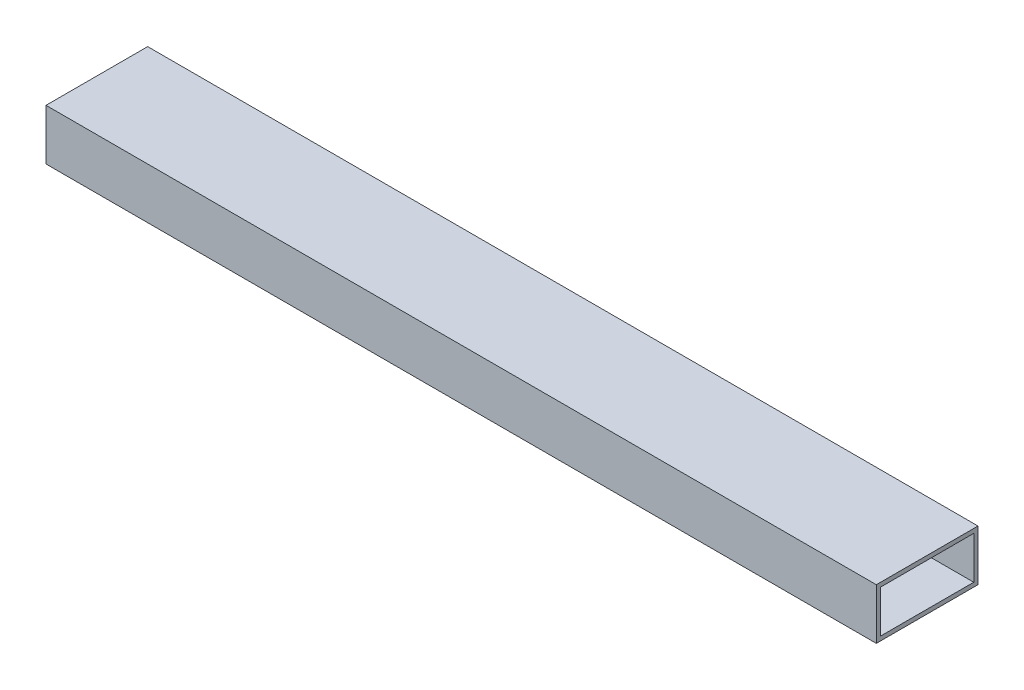
ISO-10303-21;
HEADER;
FILE_DESCRIPTION(('STEP AP214'),'2;1');
FILE_NAME('part.step','',(''),(''),'','','');
FILE_SCHEMA(('AUTOMOTIVE_DESIGN { 1 0 10303 214 1 1 1 1 }'));
ENDSEC;
DATA;
#1=APPLICATION_CONTEXT('core data for automotive mechanical design processes');
#2=APPLICATION_PROTOCOL_DEFINITION('international standard','automotive_design',2000,#1);
#3=PRODUCT_CONTEXT('',#1,'mechanical');
#4=PRODUCT('Part','Part','',(#3));
#5=PRODUCT_RELATED_PRODUCT_CATEGORY('part','',(#4));
#6=PRODUCT_DEFINITION_FORMATION('','',#4);
#7=PRODUCT_DEFINITION_CONTEXT('part definition',#1,'design');
#8=PRODUCT_DEFINITION('design','',#6,#7);
#9=PRODUCT_DEFINITION_SHAPE('','',#8);
#10=(LENGTH_UNIT() NAMED_UNIT(*) SI_UNIT(.MILLI.,.METRE.));
#11=(NAMED_UNIT(*) PLANE_ANGLE_UNIT() SI_UNIT($,.RADIAN.));
#12=(NAMED_UNIT(*) SI_UNIT($,.STERADIAN.) SOLID_ANGLE_UNIT());
#13=UNCERTAINTY_MEASURE_WITH_UNIT(LENGTH_MEASURE(1.E-05),#10,'distance_accuracy_value','');
#14=(GEOMETRIC_REPRESENTATION_CONTEXT(3) GLOBAL_UNCERTAINTY_ASSIGNED_CONTEXT((#13)) GLOBAL_UNIT_ASSIGNED_CONTEXT((#10,
#11,#12)) REPRESENTATION_CONTEXT('',''));
#15=CARTESIAN_POINT('',(0.,0.,0.));
#16=DIRECTION('',(0.,0.,1.));
#17=DIRECTION('',(1.,0.,0.));
#18=AXIS2_PLACEMENT_3D('',#15,#16,#17);
#19=CARTESIAN_POINT('',(311.15,0.,0.));
#20=DIRECTION('',(1.,0.,0.));
#21=DIRECTION('',(0.,0.,-1.));
#22=AXIS2_PLACEMENT_3D('',#19,#20,#21);
#23=PLANE('',#22);
#24=DIRECTION('',(0.,1.,0.));
#25=VECTOR('',#24,1.);
#26=CARTESIAN_POINT('',(311.15,0.,-76.2));
#27=LINE('',#26,#25);
#28=CARTESIAN_POINT('',(311.15,0.,-76.2));
#29=VERTEX_POINT('',#28);
#30=CARTESIAN_POINT('',(311.15,38.1,-76.2));
#31=VERTEX_POINT('',#30);
#32=EDGE_CURVE('E139',#29,#31,#27,.T.);
#33=ORIENTED_EDGE('',*,*,#32,.T.);
#34=DIRECTION('',(0.,0.,1.));
#35=VECTOR('',#34,1.);
#36=CARTESIAN_POINT('',(311.15,38.1,-76.2));
#37=LINE('',#36,#35);
#38=CARTESIAN_POINT('',(311.15,38.1,0.));
#39=VERTEX_POINT('',#38);
#40=EDGE_CURVE('E142',#31,#39,#37,.T.);
#41=ORIENTED_EDGE('',*,*,#40,.T.);
#42=DIRECTION('',(0.,-1.,0.));
#43=VECTOR('',#42,1.);
#44=CARTESIAN_POINT('',(311.15,0.,0.));
#45=LINE('',#44,#43);
#46=CARTESIAN_POINT('',(311.15,0.,0.));
#47=VERTEX_POINT('',#46);
#48=EDGE_CURVE('E145',#39,#47,#45,.T.);
#49=ORIENTED_EDGE('',*,*,#48,.T.);
#50=DIRECTION('',(0.,0.,-1.));
#51=VECTOR('',#50,1.);
#52=CARTESIAN_POINT('',(311.15,0.,-76.2));
#53=LINE('',#52,#51);
#54=EDGE_CURVE('E147',#47,#29,#53,.T.);
#55=ORIENTED_EDGE('',*,*,#54,.T.);
#56=EDGE_LOOP('',(#33,#41,#49,#55));
#57=FACE_BOUND('',#56,.T.);
#58=DIRECTION('',(0.,0.,1.));
#59=VECTOR('',#58,1.);
#60=CARTESIAN_POINT('',(311.15,34.925,-73.025));
#61=LINE('',#60,#59);
#62=CARTESIAN_POINT('',(311.15,34.925,-73.025));
#63=VERTEX_POINT('',#62);
#64=CARTESIAN_POINT('',(311.15,34.925,-3.175));
#65=VERTEX_POINT('',#64);
#66=EDGE_CURVE('E109',#63,#65,#61,.T.);
#67=ORIENTED_EDGE('',*,*,#66,.F.);
#68=DIRECTION('',(0.,1.,0.));
#69=VECTOR('',#68,1.);
#70=CARTESIAN_POINT('',(311.15,3.175,-73.025));
#71=LINE('',#70,#69);
#72=CARTESIAN_POINT('',(311.15,3.175,-73.025));
#73=VERTEX_POINT('',#72);
#74=EDGE_CURVE('E101',#73,#63,#71,.T.);
#75=ORIENTED_EDGE('',*,*,#74,.F.);
#76=DIRECTION('',(0.,0.,-1.));
#77=VECTOR('',#76,1.);
#78=CARTESIAN_POINT('',(311.15,3.175,-73.025));
#79=LINE('',#78,#77);
#80=CARTESIAN_POINT('',(311.15,3.175,-3.175));
#81=VERTEX_POINT('',#80);
#82=EDGE_CURVE('E123',#81,#73,#79,.T.);
#83=ORIENTED_EDGE('',*,*,#82,.F.);
#84=DIRECTION('',(0.,-1.,0.));
#85=VECTOR('',#84,1.);
#86=CARTESIAN_POINT('',(311.15,3.175,-3.175));
#87=LINE('',#86,#85);
#88=EDGE_CURVE('E121',#65,#81,#87,.T.);
#89=ORIENTED_EDGE('',*,*,#88,.F.);
#90=EDGE_LOOP('',(#67,#75,#83,#89));
#91=FACE_BOUND('',#90,.T.);
#92=ADVANCED_FACE('F36',(#57,#91),#23,.T.);
#93=CARTESIAN_POINT('',(-311.15,0.,0.));
#94=DIRECTION('',(1.,0.,0.));
#95=DIRECTION('',(0.,0.,-1.));
#96=AXIS2_PLACEMENT_3D('',#93,#94,#95);
#97=PLANE('',#96);
#98=DIRECTION('',(0.,1.,0.));
#99=VECTOR('',#98,1.);
#100=CARTESIAN_POINT('',(-311.15,0.,-76.2));
#101=LINE('',#100,#99);
#102=CARTESIAN_POINT('',(-311.15,0.,-76.2));
#103=VERTEX_POINT('',#102);
#104=CARTESIAN_POINT('',(-311.15,38.1,-76.2));
#105=VERTEX_POINT('',#104);
#106=EDGE_CURVE('E117',#103,#105,#101,.T.);
#107=ORIENTED_EDGE('',*,*,#106,.F.);
#108=DIRECTION('',(0.,0.,-1.));
#109=VECTOR('',#108,1.);
#110=CARTESIAN_POINT('',(-311.15,0.,-76.2));
#111=LINE('',#110,#109);
#112=CARTESIAN_POINT('',(-311.15,0.,0.));
#113=VERTEX_POINT('',#112);
#114=EDGE_CURVE('E143',#113,#103,#111,.T.);
#115=ORIENTED_EDGE('',*,*,#114,.F.);
#116=DIRECTION('',(0.,-1.,0.));
#117=VECTOR('',#116,1.);
#118=CARTESIAN_POINT('',(-311.15,0.,0.));
#119=LINE('',#118,#117);
#120=CARTESIAN_POINT('',(-311.15,38.1,0.));
#121=VERTEX_POINT('',#120);
#122=EDGE_CURVE('E154',#121,#113,#119,.T.);
#123=ORIENTED_EDGE('',*,*,#122,.F.);
#124=DIRECTION('',(0.,0.,1.));
#125=VECTOR('',#124,1.);
#126=CARTESIAN_POINT('',(-311.15,38.1,-76.2));
#127=LINE('',#126,#125);
#128=EDGE_CURVE('E152',#105,#121,#127,.T.);
#129=ORIENTED_EDGE('',*,*,#128,.F.);
#130=EDGE_LOOP('',(#107,#115,#123,#129));
#131=FACE_BOUND('',#130,.T.);
#132=DIRECTION('',(0.,1.,0.));
#133=VECTOR('',#132,1.);
#134=CARTESIAN_POINT('',(-311.15,3.175,-73.025));
#135=LINE('',#134,#133);
#136=CARTESIAN_POINT('',(-311.15,3.175,-73.025));
#137=VERTEX_POINT('',#136);
#138=CARTESIAN_POINT('',(-311.15,34.925,-73.025));
#139=VERTEX_POINT('',#138);
#140=EDGE_CURVE('E59',#137,#139,#135,.T.);
#141=ORIENTED_EDGE('',*,*,#140,.T.);
#142=DIRECTION('',(0.,0.,1.));
#143=VECTOR('',#142,1.);
#144=CARTESIAN_POINT('',(-311.15,34.925,-73.025));
#145=LINE('',#144,#143);
#146=CARTESIAN_POINT('',(-311.15,34.925,-3.175));
#147=VERTEX_POINT('',#146);
#148=EDGE_CURVE('E116',#139,#147,#145,.T.);
#149=ORIENTED_EDGE('',*,*,#148,.T.);
#150=DIRECTION('',(0.,-1.,0.));
#151=VECTOR('',#150,1.);
#152=CARTESIAN_POINT('',(-311.15,3.175,-3.175));
#153=LINE('',#152,#151);
#154=CARTESIAN_POINT('',(-311.15,3.175,-3.175));
#155=VERTEX_POINT('',#154);
#156=EDGE_CURVE('E131',#147,#155,#153,.T.);
#157=ORIENTED_EDGE('',*,*,#156,.T.);
#158=DIRECTION('',(0.,0.,-1.));
#159=VECTOR('',#158,1.);
#160=CARTESIAN_POINT('',(-311.15,3.175,-73.025));
#161=LINE('',#160,#159);
#162=EDGE_CURVE('E110',#155,#137,#161,.T.);
#163=ORIENTED_EDGE('',*,*,#162,.T.);
#164=EDGE_LOOP('',(#141,#149,#157,#163));
#165=FACE_BOUND('',#164,.T.);
#166=ADVANCED_FACE('F172',(#131,#165),#97,.F.);
#167=CARTESIAN_POINT('',(311.15,0.,-76.2));
#168=DIRECTION('',(0.,0.,1.));
#169=DIRECTION('',(0.,-1.,0.));
#170=AXIS2_PLACEMENT_3D('',#167,#168,#169);
#171=PLANE('',#170);
#172=CARTESIAN_POINT('',(-260.35,19.05,-76.2));
#173=DIRECTION('',(0.,0.,-1.));
#174=DIRECTION('',(0.,1.,0.));
#175=AXIS2_PLACEMENT_3D('',#172,#173,#174);
#176=CIRCLE('',#175,2.55269999999996);
#177=CARTESIAN_POINT('',(-260.35,21.6027,-76.2));
#178=VERTEX_POINT('',#177);
#179=EDGE_CURVE('E220',#178,#178,#176,.T.);
#180=ORIENTED_EDGE('',*,*,#179,.F.);
#181=EDGE_LOOP('',(#180));
#182=FACE_BOUND('',#181,.T.);
#183=CARTESIAN_POINT('',(260.35,19.05,-76.2));
#184=DIRECTION('',(0.,0.,-1.));
#185=DIRECTION('',(0.,1.,0.));
#186=AXIS2_PLACEMENT_3D('',#183,#184,#185);
#187=CIRCLE('',#186,2.55269999999996);
#188=CARTESIAN_POINT('',(260.35,21.6027,-76.2));
#189=VERTEX_POINT('',#188);
#190=EDGE_CURVE('E215',#189,#189,#187,.T.);
#191=ORIENTED_EDGE('',*,*,#190,.F.);
#192=EDGE_LOOP('',(#191));
#193=FACE_BOUND('',#192,.T.);
#194=ORIENTED_EDGE('',*,*,#106,.T.);
#195=DIRECTION('',(-1.,0.,0.));
#196=VECTOR('',#195,1.);
#197=CARTESIAN_POINT('',(311.15,38.1,-76.2));
#198=LINE('',#197,#196);
#199=EDGE_CURVE('E11',#31,#105,#198,.T.);
#200=ORIENTED_EDGE('',*,*,#199,.F.);
#201=ORIENTED_EDGE('',*,*,#32,.F.);
#202=DIRECTION('',(-1.,0.,0.));
#203=VECTOR('',#202,1.);
#204=CARTESIAN_POINT('',(311.15,0.,-76.2));
#205=LINE('',#204,#203);
#206=EDGE_CURVE('E149',#29,#103,#205,.T.);
#207=ORIENTED_EDGE('',*,*,#206,.T.);
#208=EDGE_LOOP('',(#194,#200,#201,#207));
#209=FACE_BOUND('',#208,.T.);
#210=ADVANCED_FACE('F38',(#182,#193,#209),#171,.F.);
#211=CARTESIAN_POINT('',(311.15,38.1,-76.2));
#212=DIRECTION('',(0.,-1.,0.));
#213=DIRECTION('',(0.,0.,-1.));
#214=AXIS2_PLACEMENT_3D('',#211,#212,#213);
#215=PLANE('',#214);
#216=ORIENTED_EDGE('',*,*,#128,.T.);
#217=DIRECTION('',(-1.,0.,0.));
#218=VECTOR('',#217,1.);
#219=CARTESIAN_POINT('',(311.15,38.1,0.));
#220=LINE('',#219,#218);
#221=EDGE_CURVE('E44',#39,#121,#220,.T.);
#222=ORIENTED_EDGE('',*,*,#221,.F.);
#223=ORIENTED_EDGE('',*,*,#40,.F.);
#224=ORIENTED_EDGE('',*,*,#199,.T.);
#225=EDGE_LOOP('',(#216,#222,#223,#224));
#226=FACE_BOUND('',#225,.T.);
#227=ADVANCED_FACE('F182',(#226),#215,.F.);
#228=CARTESIAN_POINT('',(311.15,0.,0.));
#229=DIRECTION('',(0.,0.,-1.));
#230=DIRECTION('',(0.,1.,0.));
#231=AXIS2_PLACEMENT_3D('',#228,#229,#230);
#232=PLANE('',#231);
#233=ORIENTED_EDGE('',*,*,#122,.T.);
#234=DIRECTION('',(-1.,0.,0.));
#235=VECTOR('',#234,1.);
#236=CARTESIAN_POINT('',(311.15,0.,0.));
#237=LINE('',#236,#235);
#238=EDGE_CURVE('E159',#47,#113,#237,.T.);
#239=ORIENTED_EDGE('',*,*,#238,.F.);
#240=ORIENTED_EDGE('',*,*,#48,.F.);
#241=ORIENTED_EDGE('',*,*,#221,.T.);
#242=EDGE_LOOP('',(#233,#239,#240,#241));
#243=FACE_BOUND('',#242,.T.);
#244=ADVANCED_FACE('F166',(#243),#232,.F.);
#245=CARTESIAN_POINT('',(311.15,0.,-76.2));
#246=DIRECTION('',(0.,1.,0.));
#247=DIRECTION('',(0.,0.,1.));
#248=AXIS2_PLACEMENT_3D('',#245,#246,#247);
#249=PLANE('',#248);
#250=ORIENTED_EDGE('',*,*,#114,.T.);
#251=ORIENTED_EDGE('',*,*,#206,.F.);
#252=ORIENTED_EDGE('',*,*,#54,.F.);
#253=ORIENTED_EDGE('',*,*,#238,.T.);
#254=EDGE_LOOP('',(#250,#251,#252,#253));
#255=FACE_BOUND('',#254,.T.);
#256=ADVANCED_FACE('F176',(#255),#249,.F.);
#257=CARTESIAN_POINT('',(311.15,3.175,-73.025));
#258=DIRECTION('',(0.,0.,1.));
#259=DIRECTION('',(1.,0.,0.));
#260=AXIS2_PLACEMENT_3D('',#257,#258,#259);
#261=PLANE('',#260);
#262=CARTESIAN_POINT('',(-260.35,19.05,-73.025));
#263=DIRECTION('',(0.,0.,1.));
#264=DIRECTION('',(1.,0.,0.));
#265=AXIS2_PLACEMENT_3D('',#262,#263,#264);
#266=CIRCLE('',#265,2.55269999999999);
#267=CARTESIAN_POINT('',(-257.7973,19.05,-73.025));
#268=VERTEX_POINT('',#267);
#269=EDGE_CURVE('E211',#268,#268,#266,.T.);
#270=ORIENTED_EDGE('',*,*,#269,.F.);
#271=EDGE_LOOP('',(#270));
#272=FACE_BOUND('',#271,.T.);
#273=CARTESIAN_POINT('',(260.35,19.05,-73.025));
#274=DIRECTION('',(0.,0.,1.));
#275=DIRECTION('',(1.,0.,0.));
#276=AXIS2_PLACEMENT_3D('',#273,#274,#275);
#277=CIRCLE('',#276,2.55269999999999);
#278=CARTESIAN_POINT('',(262.9027,19.05,-73.025));
#279=VERTEX_POINT('',#278);
#280=EDGE_CURVE('E129',#279,#279,#277,.T.);
#281=ORIENTED_EDGE('',*,*,#280,.F.);
#282=EDGE_LOOP('',(#281));
#283=FACE_BOUND('',#282,.T.);
#284=ORIENTED_EDGE('',*,*,#140,.F.);
#285=DIRECTION('',(-1.,0.,0.));
#286=VECTOR('',#285,1.);
#287=CARTESIAN_POINT('',(311.15,3.175,-73.025));
#288=LINE('',#287,#286);
#289=EDGE_CURVE('E105',#73,#137,#288,.T.);
#290=ORIENTED_EDGE('',*,*,#289,.F.);
#291=ORIENTED_EDGE('',*,*,#74,.T.);
#292=DIRECTION('',(-1.,0.,0.));
#293=VECTOR('',#292,1.);
#294=CARTESIAN_POINT('',(311.15,34.925,-73.025));
#295=LINE('',#294,#293);
#296=EDGE_CURVE('E104',#63,#139,#295,.T.);
#297=ORIENTED_EDGE('',*,*,#296,.T.);
#298=EDGE_LOOP('',(#284,#290,#291,#297));
#299=FACE_BOUND('',#298,.T.);
#300=ADVANCED_FACE('F103',(#272,#283,#299),#261,.T.);
#301=CARTESIAN_POINT('',(311.15,34.925,-73.025));
#302=DIRECTION('',(0.,-1.,0.));
#303=DIRECTION('',(0.,0.,-1.));
#304=AXIS2_PLACEMENT_3D('',#301,#302,#303);
#305=PLANE('',#304);
#306=ORIENTED_EDGE('',*,*,#148,.F.);
#307=ORIENTED_EDGE('',*,*,#296,.F.);
#308=ORIENTED_EDGE('',*,*,#66,.T.);
#309=DIRECTION('',(-1.,0.,0.));
#310=VECTOR('',#309,1.);
#311=CARTESIAN_POINT('',(311.15,34.925,-3.175));
#312=LINE('',#311,#310);
#313=EDGE_CURVE('E118',#65,#147,#312,.T.);
#314=ORIENTED_EDGE('',*,*,#313,.T.);
#315=EDGE_LOOP('',(#306,#307,#308,#314));
#316=FACE_BOUND('',#315,.T.);
#317=ADVANCED_FACE('F113',(#316),#305,.T.);
#318=CARTESIAN_POINT('',(311.15,3.175,-3.175));
#319=DIRECTION('',(0.,0.,-1.));
#320=DIRECTION('',(-1.,0.,0.));
#321=AXIS2_PLACEMENT_3D('',#318,#319,#320);
#322=PLANE('',#321);
#323=ORIENTED_EDGE('',*,*,#156,.F.);
#324=ORIENTED_EDGE('',*,*,#313,.F.);
#325=ORIENTED_EDGE('',*,*,#88,.T.);
#326=DIRECTION('',(-1.,0.,0.));
#327=VECTOR('',#326,1.);
#328=CARTESIAN_POINT('',(311.15,3.175,-3.175));
#329=LINE('',#328,#327);
#330=EDGE_CURVE('E51',#81,#155,#329,.T.);
#331=ORIENTED_EDGE('',*,*,#330,.T.);
#332=EDGE_LOOP('',(#323,#324,#325,#331));
#333=FACE_BOUND('',#332,.T.);
#334=ADVANCED_FACE('F207',(#333),#322,.T.);
#335=CARTESIAN_POINT('',(311.15,3.175,-73.025));
#336=DIRECTION('',(0.,1.,0.));
#337=DIRECTION('',(0.,0.,1.));
#338=AXIS2_PLACEMENT_3D('',#335,#336,#337);
#339=PLANE('',#338);
#340=ORIENTED_EDGE('',*,*,#162,.F.);
#341=ORIENTED_EDGE('',*,*,#330,.F.);
#342=ORIENTED_EDGE('',*,*,#82,.T.);
#343=ORIENTED_EDGE('',*,*,#289,.T.);
#344=EDGE_LOOP('',(#340,#341,#342,#343));
#345=FACE_BOUND('',#344,.T.);
#346=ADVANCED_FACE('F231',(#345),#339,.T.);
#347=CARTESIAN_POINT('',(260.35,19.05,-76.2));
#348=DIRECTION('',(0.,0.,-1.));
#349=DIRECTION('',(0.,1.,0.));
#350=AXIS2_PLACEMENT_3D('',#347,#348,#349);
#351=CYLINDRICAL_SURFACE('',#350,2.55269999999999);
#352=ORIENTED_EDGE('',*,*,#190,.T.);
#353=EDGE_LOOP('',(#352));
#354=FACE_BOUND('',#353,.T.);
#355=ORIENTED_EDGE('',*,*,#280,.T.);
#356=EDGE_LOOP('',(#355));
#357=FACE_BOUND('',#356,.T.);
#358=ADVANCED_FACE('F229',(#354,#357),#351,.F.);
#359=CARTESIAN_POINT('',(-260.35,19.05,-76.2));
#360=DIRECTION('',(0.,0.,-1.));
#361=DIRECTION('',(0.,1.,0.));
#362=AXIS2_PLACEMENT_3D('',#359,#360,#361);
#363=CYLINDRICAL_SURFACE('',#362,2.55269999999999);
#364=ORIENTED_EDGE('',*,*,#179,.T.);
#365=EDGE_LOOP('',(#364));
#366=FACE_BOUND('',#365,.T.);
#367=ORIENTED_EDGE('',*,*,#269,.T.);
#368=EDGE_LOOP('',(#367));
#369=FACE_BOUND('',#368,.T.);
#370=ADVANCED_FACE('F224',(#366,#369),#363,.F.);
#371=CLOSED_SHELL('',(#92,#166,#210,#227,#244,#256,#300,#317,#334,#346,#358,#370));
#372=MANIFOLD_SOLID_BREP('B2',#371);
#373=ADVANCED_BREP_SHAPE_REPRESENTATION('',(#18,#372),#14);
#374=SHAPE_DEFINITION_REPRESENTATION(#9,#373);
ENDSEC;
END-ISO-10303-21;
